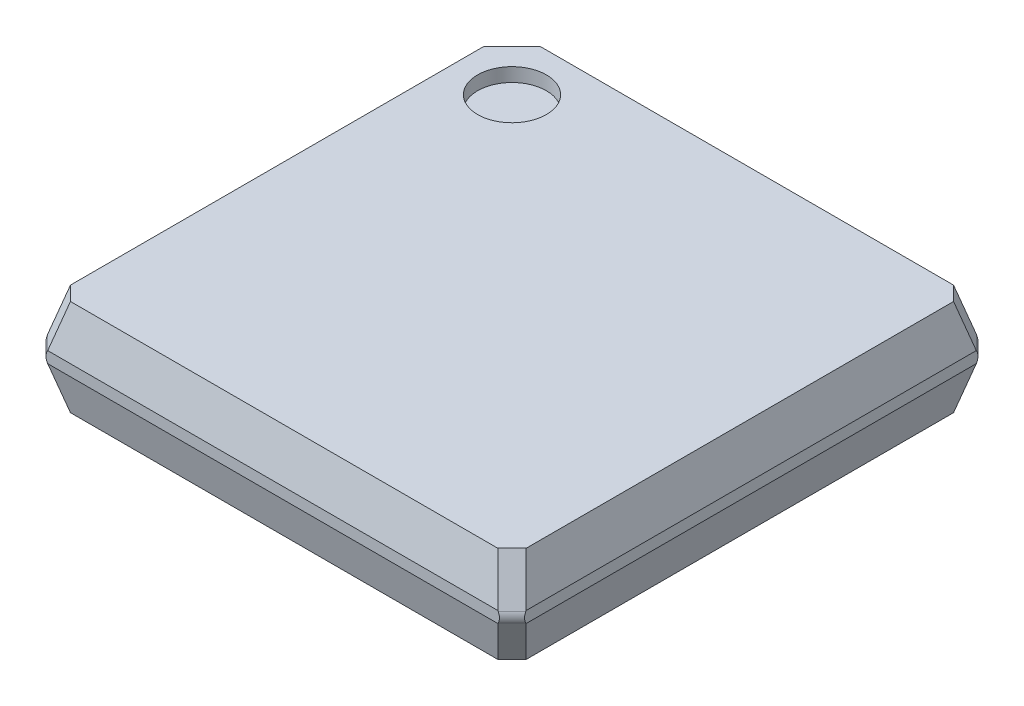
ISO-10303-21;
HEADER;
FILE_DESCRIPTION(('STEP AP214'),'2;1');
FILE_NAME('part.step','',(''),(''),'','','');
FILE_SCHEMA(('AUTOMOTIVE_DESIGN { 1 0 10303 214 1 1 1 1 }'));
ENDSEC;
DATA;
#1=APPLICATION_CONTEXT('core data for automotive mechanical design processes');
#2=APPLICATION_PROTOCOL_DEFINITION('international standard','automotive_design',2000,#1);
#3=PRODUCT_CONTEXT('',#1,'mechanical');
#4=PRODUCT('Part','Part','',(#3));
#5=PRODUCT_RELATED_PRODUCT_CATEGORY('part','',(#4));
#6=PRODUCT_DEFINITION_FORMATION('','',#4);
#7=PRODUCT_DEFINITION_CONTEXT('part definition',#1,'design');
#8=PRODUCT_DEFINITION('design','',#6,#7);
#9=PRODUCT_DEFINITION_SHAPE('','',#8);
#10=(LENGTH_UNIT() NAMED_UNIT(*) SI_UNIT(.MILLI.,.METRE.));
#11=(NAMED_UNIT(*) PLANE_ANGLE_UNIT() SI_UNIT($,.RADIAN.));
#12=(NAMED_UNIT(*) SI_UNIT($,.STERADIAN.) SOLID_ANGLE_UNIT());
#13=UNCERTAINTY_MEASURE_WITH_UNIT(LENGTH_MEASURE(1.E-05),#10,'distance_accuracy_value','');
#14=(GEOMETRIC_REPRESENTATION_CONTEXT(3) GLOBAL_UNCERTAINTY_ASSIGNED_CONTEXT((#13)) GLOBAL_UNIT_ASSIGNED_CONTEXT((#10,
#11,#12)) REPRESENTATION_CONTEXT('',''));
#15=CARTESIAN_POINT('',(0.,0.,0.));
#16=DIRECTION('',(0.,0.,1.));
#17=DIRECTION('',(1.,0.,0.));
#18=AXIS2_PLACEMENT_3D('',#15,#16,#17);
#19=CARTESIAN_POINT('',(-2.5,0.5,-2.5));
#20=DIRECTION('',(0.,1.,0.));
#21=DIRECTION('',(0.,0.,1.));
#22=AXIS2_PLACEMENT_3D('',#19,#20,#21);
#23=PLANE('',#22);
#24=CARTESIAN_POINT('',(-2.5,0.5,-2.5));
#25=DIRECTION('',(0.,-1.,0.));
#26=DIRECTION('',(0.,0.,-1.));
#27=AXIS2_PLACEMENT_3D('',#24,#25,#26);
#28=CIRCLE('',#27,0.5);
#29=CARTESIAN_POINT('',(-2.5,0.5,-3.));
#30=VERTEX_POINT('',#29);
#31=EDGE_CURVE('E19',#30,#30,#28,.F.);
#32=ORIENTED_EDGE('',*,*,#31,.T.);
#33=EDGE_LOOP('',(#32));
#34=FACE_BOUND('',#33,.T.);
#35=ADVANCED_FACE('F16',(#34),#23,.T.);
#36=CARTESIAN_POINT('',(-2.5,0.7,-2.5));
#37=DIRECTION('',(0.,-1.,0.));
#38=DIRECTION('',(0.,0.,-1.));
#39=AXIS2_PLACEMENT_3D('',#36,#37,#38);
#40=CYLINDRICAL_SURFACE('',#39,0.5);
#41=CARTESIAN_POINT('',(-2.5,0.7,-2.5));
#42=DIRECTION('',(0.,-1.,0.));
#43=DIRECTION('',(0.,0.,-1.));
#44=AXIS2_PLACEMENT_3D('',#41,#42,#43);
#45=CIRCLE('',#44,0.5);
#46=CARTESIAN_POINT('',(-2.5,0.7,-3.));
#47=VERTEX_POINT('',#46);
#48=EDGE_CURVE('E321',#47,#47,#45,.T.);
#49=ORIENTED_EDGE('',*,*,#48,.F.);
#50=EDGE_LOOP('',(#49));
#51=FACE_BOUND('',#50,.T.);
#52=ORIENTED_EDGE('',*,*,#31,.F.);
#53=EDGE_LOOP('',(#52));
#54=FACE_BOUND('',#53,.T.);
#55=ADVANCED_FACE('F376',(#51,#54),#40,.F.);
#56=CARTESIAN_POINT('',(0.,0.7,0.));
#57=DIRECTION('',(0.,1.,0.));
#58=DIRECTION('',(0.,0.,1.));
#59=AXIS2_PLACEMENT_3D('',#56,#57,#58);
#60=PLANE('',#59);
#61=ORIENTED_EDGE('',*,*,#48,.T.);
#62=EDGE_LOOP('',(#61));
#63=FACE_BOUND('',#62,.T.);
#64=DIRECTION('',(0.707106781186547,0.,0.707106781186548));
#65=VECTOR('',#64,1.);
#66=CARTESIAN_POINT('',(-3.20914048806277,0.700000000000001,3.20914048806277));
#67=LINE('',#66,#65);
#68=CARTESIAN_POINT('',(-3.10584541082731,0.7,3.31243556529822));
#69=VERTEX_POINT('',#68);
#70=CARTESIAN_POINT('',(-3.31243556529822,0.7,3.10584541082731));
#71=VERTEX_POINT('',#70);
#72=EDGE_CURVE('E296',#69,#71,#67,.F.);
#73=ORIENTED_EDGE('',*,*,#72,.F.);
#74=DIRECTION('',(1.,0.,0.));
#75=VECTOR('',#74,1.);
#76=CARTESIAN_POINT('',(-1.75,0.699999999999999,3.31243556529822));
#77=LINE('',#76,#75);
#78=CARTESIAN_POINT('',(3.10584541082731,0.7,3.31243556529822));
#79=VERTEX_POINT('',#78);
#80=EDGE_CURVE('E302',#79,#69,#77,.F.);
#81=ORIENTED_EDGE('',*,*,#80,.F.);
#82=DIRECTION('',(0.707106781186547,0.,-0.707106781186547));
#83=VECTOR('',#82,1.);
#84=CARTESIAN_POINT('',(3.10584541082731,0.7,3.31243556529822));
#85=LINE('',#84,#83);
#86=CARTESIAN_POINT('',(3.31243556529822,0.7,3.10584541082731));
#87=VERTEX_POINT('',#86);
#88=EDGE_CURVE('E328',#79,#87,#85,.T.);
#89=ORIENTED_EDGE('',*,*,#88,.T.);
#90=DIRECTION('',(0.,0.,1.));
#91=VECTOR('',#90,1.);
#92=CARTESIAN_POINT('',(3.31243556529822,0.699999999999999,1.75));
#93=LINE('',#92,#91);
#94=CARTESIAN_POINT('',(3.31243556529822,0.7,-3.10584541082731));
#95=VERTEX_POINT('',#94);
#96=EDGE_CURVE('E231',#95,#87,#93,.T.);
#97=ORIENTED_EDGE('',*,*,#96,.F.);
#98=DIRECTION('',(-0.707106781186547,0.,-0.707106781186548));
#99=VECTOR('',#98,1.);
#100=CARTESIAN_POINT('',(3.20914048806277,0.700000000000001,-3.20914048806277));
#101=LINE('',#100,#99);
#102=CARTESIAN_POINT('',(3.10584541082731,0.7,-3.31243556529822));
#103=VERTEX_POINT('',#102);
#104=EDGE_CURVE('E244',#103,#95,#101,.F.);
#105=ORIENTED_EDGE('',*,*,#104,.F.);
#106=DIRECTION('',(1.,0.,0.));
#107=VECTOR('',#106,1.);
#108=CARTESIAN_POINT('',(1.75,0.699999999999999,-3.31243556529822));
#109=LINE('',#108,#107);
#110=CARTESIAN_POINT('',(-2.89925525635641,0.699999999999999,-3.31243556529822));
#111=VERTEX_POINT('',#110);
#112=EDGE_CURVE('E257',#111,#103,#109,.T.);
#113=ORIENTED_EDGE('',*,*,#112,.F.);
#114=DIRECTION('',(-0.707106781186548,0.,0.707106781186547));
#115=VECTOR('',#114,1.);
#116=CARTESIAN_POINT('',(-3.10584541082731,0.699999999999998,-3.10584541082731));
#117=LINE('',#116,#115);
#118=CARTESIAN_POINT('',(-3.31243556529822,0.699999999999998,-2.89925525635641));
#119=VERTEX_POINT('',#118);
#120=EDGE_CURVE('E270',#119,#111,#117,.F.);
#121=ORIENTED_EDGE('',*,*,#120,.F.);
#122=DIRECTION('',(0.,0.,1.));
#123=VECTOR('',#122,1.);
#124=CARTESIAN_POINT('',(-3.31243556529822,0.699999999999999,-1.75));
#125=LINE('',#124,#123);
#126=EDGE_CURVE('E283',#71,#119,#125,.F.);
#127=ORIENTED_EDGE('',*,*,#126,.F.);
#128=EDGE_LOOP('',(#73,#81,#89,#97,#105,#113,#121,#127));
#129=FACE_BOUND('',#128,.T.);
#130=ADVANCED_FACE('F373',(#63,#129),#60,.T.);
#131=CARTESIAN_POINT('',(-1.75,0.35,3.40621778264911));
#132=DIRECTION('',(0.,0.258819045102521,0.965925826289068));
#133=DIRECTION('',(0.,-0.965925826289068,0.258819045102521));
#134=AXIS2_PLACEMENT_3D('',#131,#132,#133);
#135=PLANE('',#134);
#136=ORIENTED_EDGE('',*,*,#80,.T.);
#137=DIRECTION('',(0.250562807085731,0.93511312653103,-0.250562807085731));
#138=VECTOR('',#137,1.);
#139=CARTESIAN_POINT('',(-2.99874950137879,1.0996873753447,3.20533965584969));
#140=LINE('',#139,#138);
#141=CARTESIAN_POINT('',(-3.27141022669538,0.0821036952345711,3.47800038116629));
#142=VERTEX_POINT('',#141);
#143=EDGE_CURVE('E299',#142,#69,#140,.T.);
#144=ORIENTED_EDGE('',*,*,#143,.F.);
#145=DIRECTION('',(1.,0.,0.));
#146=VECTOR('',#145,1.);
#147=CARTESIAN_POINT('',(-1.75,0.0821036952345705,3.47800038116629));
#148=LINE('',#147,#146);
#149=CARTESIAN_POINT('',(3.27141022669538,0.0821036952345706,3.47800038116629));
#150=VERTEX_POINT('',#149);
#151=EDGE_CURVE('E305',#150,#142,#148,.F.);
#152=ORIENTED_EDGE('',*,*,#151,.F.);
#153=DIRECTION('',(-0.250562807085731,0.93511312653103,-0.250562807085731));
#154=VECTOR('',#153,1.);
#155=CARTESIAN_POINT('',(2.99874950137879,1.0996873753447,3.20533965584969));
#156=LINE('',#155,#154);
#157=EDGE_CURVE('E218',#79,#150,#156,.F.);
#158=ORIENTED_EDGE('',*,*,#157,.F.);
#159=EDGE_LOOP('',(#136,#144,#152,#158));
#160=FACE_BOUND('',#159,.T.);
#161=ADVANCED_FACE('F478',(#160),#135,.T.);
#162=CARTESIAN_POINT('',(-3.10204457861424,1.0996873753447,3.10204457861424));
#163=DIRECTION('',(-0.661224832946645,0.354349320006915,0.661224832946645));
#164=DIRECTION('',(0.707106781186547,0.,0.707106781186548));
#165=AXIS2_PLACEMENT_3D('',#162,#163,#164);
#166=PLANE('',#165);
#167=ORIENTED_EDGE('',*,*,#72,.T.);
#168=DIRECTION('',(0.250562807085732,0.93511312653103,-0.25056280708573));
#169=VECTOR('',#168,1.);
#170=CARTESIAN_POINT('',(-3.47800038116629,0.0821036952345703,3.27141022669538));
#171=LINE('',#170,#169);
#172=CARTESIAN_POINT('',(-3.47800038116629,0.0821036952345705,3.27141022669538));
#173=VERTEX_POINT('',#172);
#174=EDGE_CURVE('E293',#173,#71,#171,.T.);
#175=ORIENTED_EDGE('',*,*,#174,.F.);
#176=DIRECTION('',(0.,0.881412416655053,-0.472347490483753));
#177=VECTOR('',#176,1.);
#178=CARTESIAN_POINT('',(-3.47800038116629,0.0708698640013828,3.27743041870907));
#179=LINE('',#178,#177);
#180=CARTESIAN_POINT('',(-3.47800038116629,0.0708698640014341,3.27743041870904));
#181=VERTEX_POINT('',#180);
#182=EDGE_CURVE('E290',#181,#173,#179,.T.);
#183=ORIENTED_EDGE('',*,*,#182,.F.);
#184=DIRECTION('',(-0.707106781186548,0.,-0.707106781186548));
#185=VECTOR('',#184,1.);
#186=CARTESIAN_POINT('',(-3.37771539993768,0.0708698640013825,3.37771539993768));
#187=LINE('',#186,#185);
#188=CARTESIAN_POINT('',(-3.27743041870904,0.0708698640014322,3.47800038116629));
#189=VERTEX_POINT('',#188);
#190=EDGE_CURVE('E369',#189,#181,#187,.T.);
#191=ORIENTED_EDGE('',*,*,#190,.F.);
#192=DIRECTION('',(-0.472347490483729,-0.881412416655066,0.));
#193=VECTOR('',#192,1.);
#194=CARTESIAN_POINT('',(-3.27141022669538,0.0821036952345705,3.47800038116629));
#195=LINE('',#194,#193);
#196=EDGE_CURVE('E308',#142,#189,#195,.T.);
#197=ORIENTED_EDGE('',*,*,#196,.F.);
#198=ORIENTED_EDGE('',*,*,#143,.T.);
#199=EDGE_LOOP('',(#167,#175,#183,#191,#197,#198));
#200=FACE_BOUND('',#199,.T.);
#201=ADVANCED_FACE('F474',(#200),#166,.T.);
#202=CARTESIAN_POINT('',(-3.40621778264911,0.35,-1.75));
#203=DIRECTION('',(-0.965925826289068,0.258819045102521,0.));
#204=DIRECTION('',(-0.258819045102521,-0.965925826289068,0.));
#205=AXIS2_PLACEMENT_3D('',#202,#203,#204);
#206=PLANE('',#205);
#207=ORIENTED_EDGE('',*,*,#126,.T.);
#208=DIRECTION('',(0.250562807085732,0.935113126531029,0.250562807085732));
#209=VECTOR('',#208,1.);
#210=CARTESIAN_POINT('',(-3.21830974114332,1.05128235805038,-2.8051294322015));
#211=LINE('',#210,#209);
#212=CARTESIAN_POINT('',(-3.47800038116629,0.08210369523457,-3.06482007222448));
#213=VERTEX_POINT('',#212);
#214=EDGE_CURVE('E280',#213,#119,#211,.T.);
#215=ORIENTED_EDGE('',*,*,#214,.F.);
#216=DIRECTION('',(0.,0.,1.));
#217=VECTOR('',#216,1.);
#218=CARTESIAN_POINT('',(-3.47800038116629,0.0821036952345706,-1.75));
#219=LINE('',#218,#217);
#220=EDGE_CURVE('E286',#173,#213,#219,.F.);
#221=ORIENTED_EDGE('',*,*,#220,.F.);
#222=ORIENTED_EDGE('',*,*,#174,.T.);
#223=EDGE_LOOP('',(#207,#215,#221,#222));
#224=FACE_BOUND('',#223,.T.);
#225=ADVANCED_FACE('F470',(#224),#206,.T.);
#226=CARTESIAN_POINT('',(-3.01171958667241,1.05128235805038,-3.01171958667241));
#227=DIRECTION('',(-0.661224832946644,0.354349320006915,-0.661224832946645));
#228=DIRECTION('',(-0.707106781186548,0.,0.707106781186547));
#229=AXIS2_PLACEMENT_3D('',#226,#227,#228);
#230=PLANE('',#229);
#231=ORIENTED_EDGE('',*,*,#120,.T.);
#232=DIRECTION('',(0.25056280708573,0.93511312653103,0.250562807085732));
#233=VECTOR('',#232,1.);
#234=CARTESIAN_POINT('',(-3.06482007222448,0.0821036952345703,-3.47800038116629));
#235=LINE('',#234,#233);
#236=CARTESIAN_POINT('',(-3.06482007222448,0.0821036952345705,-3.47800038116629));
#237=VERTEX_POINT('',#236);
#238=EDGE_CURVE('E267',#237,#111,#235,.T.);
#239=ORIENTED_EDGE('',*,*,#238,.F.);
#240=DIRECTION('',(0.472347490483131,0.881412416655386,0.));
#241=VECTOR('',#240,1.);
#242=CARTESIAN_POINT('',(-3.07084026423816,0.0708698640013832,-3.47800038116629));
#243=LINE('',#242,#241);
#244=CARTESIAN_POINT('',(-3.07084026423817,0.0708698640013824,-3.47800038116629));
#245=VERTEX_POINT('',#244);
#246=EDGE_CURVE('E264',#245,#237,#243,.T.);
#247=ORIENTED_EDGE('',*,*,#246,.F.);
#248=DIRECTION('',(0.707106781186548,0.,-0.707106781186547));
#249=VECTOR('',#248,1.);
#250=CARTESIAN_POINT('',(-3.27442032270223,0.070869864001385,-3.27442032270223));
#251=LINE('',#250,#249);
#252=CARTESIAN_POINT('',(-3.47800038116629,0.0708698640013821,-3.07084026423817));
#253=VERTEX_POINT('',#252);
#254=EDGE_CURVE('E362',#253,#245,#251,.T.);
#255=ORIENTED_EDGE('',*,*,#254,.F.);
#256=DIRECTION('',(0.,-0.881412416655388,-0.472347490483128));
#257=VECTOR('',#256,1.);
#258=CARTESIAN_POINT('',(-3.47800038116629,0.0821036952345706,-3.06482007222448));
#259=LINE('',#258,#257);
#260=EDGE_CURVE('E289',#213,#253,#259,.T.);
#261=ORIENTED_EDGE('',*,*,#260,.F.);
#262=ORIENTED_EDGE('',*,*,#214,.T.);
#263=EDGE_LOOP('',(#231,#239,#247,#255,#261,#262));
#264=FACE_BOUND('',#263,.T.);
#265=ADVANCED_FACE('F466',(#264),#230,.T.);
#266=CARTESIAN_POINT('',(1.75,0.35,-3.40621778264911));
#267=DIRECTION('',(0.,0.258819045102521,-0.965925826289068));
#268=DIRECTION('',(0.,0.965925826289068,0.258819045102521));
#269=AXIS2_PLACEMENT_3D('',#266,#267,#268);
#270=PLANE('',#269);
#271=ORIENTED_EDGE('',*,*,#112,.T.);
#272=DIRECTION('',(-0.250562807085731,0.93511312653103,0.250562807085731));
#273=VECTOR('',#272,1.);
#274=CARTESIAN_POINT('',(2.99874950137879,1.0996873753447,-3.20533965584969));
#275=LINE('',#274,#273);
#276=CARTESIAN_POINT('',(3.27141022669538,0.0821036952345712,-3.47800038116629));
#277=VERTEX_POINT('',#276);
#278=EDGE_CURVE('E254',#277,#103,#275,.T.);
#279=ORIENTED_EDGE('',*,*,#278,.F.);
#280=DIRECTION('',(-1.,0.,0.));
#281=VECTOR('',#280,1.);
#282=CARTESIAN_POINT('',(1.75,0.0821036952345706,-3.47800038116629));
#283=LINE('',#282,#281);
#284=EDGE_CURVE('E260',#237,#277,#283,.F.);
#285=ORIENTED_EDGE('',*,*,#284,.F.);
#286=ORIENTED_EDGE('',*,*,#238,.T.);
#287=EDGE_LOOP('',(#271,#279,#285,#286));
#288=FACE_BOUND('',#287,.T.);
#289=ADVANCED_FACE('F462',(#288),#270,.T.);
#290=CARTESIAN_POINT('',(3.10204457861424,1.0996873753447,-3.10204457861424));
#291=DIRECTION('',(0.661224832946645,0.354349320006915,-0.661224832946645));
#292=DIRECTION('',(-0.707106781186547,0.,-0.707106781186548));
#293=AXIS2_PLACEMENT_3D('',#290,#291,#292);
#294=PLANE('',#293);
#295=ORIENTED_EDGE('',*,*,#104,.T.);
#296=DIRECTION('',(-0.250562807085732,0.93511312653103,0.25056280708573));
#297=VECTOR('',#296,1.);
#298=CARTESIAN_POINT('',(3.47800038116629,0.0821036952345703,-3.27141022669538));
#299=LINE('',#298,#297);
#300=CARTESIAN_POINT('',(3.47800038116629,0.0821036952345705,-3.27141022669538));
#301=VERTEX_POINT('',#300);
#302=EDGE_CURVE('E241',#301,#95,#299,.T.);
#303=ORIENTED_EDGE('',*,*,#302,.F.);
#304=DIRECTION('',(0.,0.881412416655055,0.472347490483749));
#305=VECTOR('',#304,1.);
#306=CARTESIAN_POINT('',(3.47800038116629,0.0708698640013827,-3.27743041870907));
#307=LINE('',#306,#305);
#308=CARTESIAN_POINT('',(3.47800038116629,0.0708698640014338,-3.27743041870904));
#309=VERTEX_POINT('',#308);
#310=EDGE_CURVE('E238',#309,#301,#307,.T.);
#311=ORIENTED_EDGE('',*,*,#310,.F.);
#312=DIRECTION('',(-0.707106781186548,0.,-0.707106781186548));
#313=VECTOR('',#312,1.);
#314=CARTESIAN_POINT('',(3.37771539993768,0.0708698640013824,-3.37771539993768));
#315=LINE('',#314,#313);
#316=CARTESIAN_POINT('',(3.27743041870904,0.0708698640014315,-3.47800038116629));
#317=VERTEX_POINT('',#316);
#318=EDGE_CURVE('E354',#317,#309,#315,.F.);
#319=ORIENTED_EDGE('',*,*,#318,.F.);
#320=DIRECTION('',(0.472347490483723,-0.881412416655069,0.));
#321=VECTOR('',#320,1.);
#322=CARTESIAN_POINT('',(3.27141022669538,0.0821036952345706,-3.47800038116629));
#323=LINE('',#322,#321);
#324=EDGE_CURVE('E263',#277,#317,#323,.T.);
#325=ORIENTED_EDGE('',*,*,#324,.F.);
#326=ORIENTED_EDGE('',*,*,#278,.T.);
#327=EDGE_LOOP('',(#295,#303,#311,#319,#325,#326));
#328=FACE_BOUND('',#327,.T.);
#329=ADVANCED_FACE('F458',(#328),#294,.T.);
#330=CARTESIAN_POINT('',(3.40621778264911,0.35,1.75));
#331=DIRECTION('',(0.965925826289068,0.258819045102521,0.));
#332=DIRECTION('',(-0.258819045102521,0.965925826289068,0.));
#333=AXIS2_PLACEMENT_3D('',#330,#331,#332);
#334=PLANE('',#333);
#335=ORIENTED_EDGE('',*,*,#96,.T.);
#336=DIRECTION('',(-0.250562807085731,0.93511312653103,-0.250562807085731));
#337=VECTOR('',#336,1.);
#338=CARTESIAN_POINT('',(3.20533965584969,1.0996873753447,2.99874950137879));
#339=LINE('',#338,#337);
#340=CARTESIAN_POINT('',(3.47800038116629,0.0821036952345712,3.27141022669538));
#341=VERTEX_POINT('',#340);
#342=EDGE_CURVE('E228',#341,#87,#339,.T.);
#343=ORIENTED_EDGE('',*,*,#342,.F.);
#344=DIRECTION('',(0.,0.,-1.));
#345=VECTOR('',#344,1.);
#346=CARTESIAN_POINT('',(3.47800038116629,0.0821036952345706,1.75));
#347=LINE('',#346,#345);
#348=EDGE_CURVE('E234',#301,#341,#347,.F.);
#349=ORIENTED_EDGE('',*,*,#348,.F.);
#350=ORIENTED_EDGE('',*,*,#302,.T.);
#351=EDGE_LOOP('',(#335,#343,#349,#350));
#352=FACE_BOUND('',#351,.T.);
#353=ADVANCED_FACE('F454',(#352),#334,.T.);
#354=CARTESIAN_POINT('',(3.10204457861424,1.0996873753447,3.10204457861424));
#355=DIRECTION('',(0.661224832946645,0.354349320006915,0.661224832946645));
#356=DIRECTION('',(0.707106781186548,0.,-0.707106781186547));
#357=AXIS2_PLACEMENT_3D('',#354,#355,#356);
#358=PLANE('',#357);
#359=DIRECTION('',(-0.472347490483753,0.881412416655053,0.));
#360=VECTOR('',#359,1.);
#361=CARTESIAN_POINT('',(3.27743041870907,0.0708698640013827,3.47800038116629));
#362=LINE('',#361,#360);
#363=CARTESIAN_POINT('',(3.27743041870904,0.0708698640014341,3.47800038116629));
#364=VERTEX_POINT('',#363);
#365=EDGE_CURVE('E187',#364,#150,#362,.T.);
#366=ORIENTED_EDGE('',*,*,#365,.F.);
#367=DIRECTION('',(0.707106781186548,0.,-0.707106781186548));
#368=VECTOR('',#367,1.);
#369=CARTESIAN_POINT('',(3.37771539993768,0.0708698640013824,3.37771539993768));
#370=LINE('',#369,#368);
#371=CARTESIAN_POINT('',(3.47800038116629,0.0708698640014315,3.27743041870904));
#372=VERTEX_POINT('',#371);
#373=EDGE_CURVE('E183',#372,#364,#370,.F.);
#374=ORIENTED_EDGE('',*,*,#373,.F.);
#375=DIRECTION('',(0.,-0.881412416655069,0.472347490483723));
#376=VECTOR('',#375,1.);
#377=CARTESIAN_POINT('',(3.47800038116629,0.0821036952345706,3.27141022669538));
#378=LINE('',#377,#376);
#379=EDGE_CURVE('E237',#341,#372,#378,.T.);
#380=ORIENTED_EDGE('',*,*,#379,.F.);
#381=ORIENTED_EDGE('',*,*,#342,.T.);
#382=ORIENTED_EDGE('',*,*,#88,.F.);
#383=ORIENTED_EDGE('',*,*,#157,.T.);
#384=EDGE_LOOP('',(#366,#374,#380,#381,#382,#383));
#385=FACE_BOUND('',#384,.T.);
#386=ADVANCED_FACE('F451',(#385),#358,.T.);
#387=CARTESIAN_POINT('',(3.24547043334835,0.,3.24547043334835));
#388=DIRECTION('',(0.707106781186548,0.,-0.707106781186548));
#389=DIRECTION('',(-0.707106781186548,0.,-0.707106781186548));
#390=AXIS2_PLACEMENT_3D('',#387,#388,#389);
#391=CYLINDRICAL_SURFACE('',#390,0.2);
#392=CARTESIAN_POINT('',(3.01294048553041,0.,3.47800038116629));
#393=DIRECTION('',(0.,0.,1.));
#394=DIRECTION('',(1.,0.,0.));
#395=AXIS2_PLACEMENT_3D('',#392,#393,#394);
#396=ELLIPSE('',#395,0.282842712474619,0.2);
#397=CARTESIAN_POINT('',(3.27743041870906,-0.0708698640014056,3.47800038116629));
#398=VERTEX_POINT('',#397);
#399=EDGE_CURVE('E176',#398,#364,#396,.T.);
#400=ORIENTED_EDGE('',*,*,#399,.F.);
#401=DIRECTION('',(0.707106781186548,0.,-0.707106781186547));
#402=VECTOR('',#401,1.);
#403=CARTESIAN_POINT('',(3.37771539993768,-0.070869864001382,3.37771539993768));
#404=LINE('',#403,#402);
#405=CARTESIAN_POINT('',(3.47800038116629,-0.0708698640014027,3.27743041870906));
#406=VERTEX_POINT('',#405);
#407=EDGE_CURVE('E181',#406,#398,#404,.F.);
#408=ORIENTED_EDGE('',*,*,#407,.F.);
#409=CARTESIAN_POINT('',(3.47800038116629,0.,3.01294048553041));
#410=DIRECTION('',(1.,0.,0.));
#411=DIRECTION('',(0.,0.,-1.));
#412=AXIS2_PLACEMENT_3D('',#409,#410,#411);
#413=ELLIPSE('',#412,0.282842712474619,0.2);
#414=EDGE_CURVE('E349',#372,#406,#413,.T.);
#415=ORIENTED_EDGE('',*,*,#414,.F.);
#416=ORIENTED_EDGE('',*,*,#373,.T.);
#417=EDGE_LOOP('',(#400,#408,#415,#416));
#418=FACE_BOUND('',#417,.T.);
#419=ADVANCED_FACE('F178',(#418),#391,.T.);
#420=CARTESIAN_POINT('',(-1.75,0.,3.47800038116629));
#421=DIRECTION('',(0.,0.,1.));
#422=DIRECTION('',(1.,0.,0.));
#423=AXIS2_PLACEMENT_3D('',#420,#421,#422);
#424=PLANE('',#423);
#425=ORIENTED_EDGE('',*,*,#196,.T.);
#426=CARTESIAN_POINT('',(-3.01294048553041,0.,3.47800038116629));
#427=DIRECTION('',(0.,0.,1.));
#428=DIRECTION('',(-1.,0.,0.));
#429=AXIS2_PLACEMENT_3D('',#426,#427,#428);
#430=ELLIPSE('',#429,0.282842712474619,0.2);
#431=CARTESIAN_POINT('',(-3.27743041870904,-0.0708698640014314,3.47800038116629));
#432=VERTEX_POINT('',#431);
#433=EDGE_CURVE('E367',#432,#189,#430,.F.);
#434=ORIENTED_EDGE('',*,*,#433,.F.);
#435=DIRECTION('',(0.472347490483723,-0.881412416655069,0.));
#436=VECTOR('',#435,1.);
#437=CARTESIAN_POINT('',(-3.27743041870907,-0.0708698640013827,3.47800038116629));
#438=LINE('',#437,#436);
#439=CARTESIAN_POINT('',(-3.27141022669538,-0.0821036952345705,3.47800038116629));
#440=VERTEX_POINT('',#439);
#441=EDGE_CURVE('E188',#432,#440,#438,.T.);
#442=ORIENTED_EDGE('',*,*,#441,.T.);
#443=DIRECTION('',(1.,0.,0.));
#444=VECTOR('',#443,1.);
#445=CARTESIAN_POINT('',(-1.75,-0.0821036952345703,3.47800038116629));
#446=LINE('',#445,#444);
#447=CARTESIAN_POINT('',(3.27141022669538,-0.0821036952345716,3.47800038116629));
#448=VERTEX_POINT('',#447);
#449=EDGE_CURVE('E194',#448,#440,#446,.F.);
#450=ORIENTED_EDGE('',*,*,#449,.F.);
#451=DIRECTION('',(-0.472347490483418,-0.881412416655232,3.06241499784307E-13));
#452=VECTOR('',#451,1.);
#453=CARTESIAN_POINT('',(3.27743041870907,-0.070869864001382,3.47800038116629));
#454=LINE('',#453,#452);
#455=EDGE_CURVE('E191',#398,#448,#454,.T.);
#456=ORIENTED_EDGE('',*,*,#455,.F.);
#457=ORIENTED_EDGE('',*,*,#399,.T.);
#458=ORIENTED_EDGE('',*,*,#365,.T.);
#459=ORIENTED_EDGE('',*,*,#151,.T.);
#460=EDGE_LOOP('',(#425,#434,#442,#450,#456,#457,#458,#459));
#461=FACE_BOUND('',#460,.T.);
#462=ADVANCED_FACE('F192',(#461),#424,.T.);
#463=CARTESIAN_POINT('',(-3.24547043334835,0.,3.24547043334835));
#464=DIRECTION('',(-0.707106781186548,0.,-0.707106781186548));
#465=DIRECTION('',(-0.707106781186548,0.,0.707106781186548));
#466=AXIS2_PLACEMENT_3D('',#463,#464,#465);
#467=CYLINDRICAL_SURFACE('',#466,0.2);
#468=ORIENTED_EDGE('',*,*,#433,.T.);
#469=ORIENTED_EDGE('',*,*,#190,.T.);
#470=CARTESIAN_POINT('',(-3.47800038116629,0.,3.01294048553041));
#471=DIRECTION('',(-1.,0.,0.));
#472=DIRECTION('',(0.,0.,-1.));
#473=AXIS2_PLACEMENT_3D('',#470,#471,#472);
#474=ELLIPSE('',#473,0.282842712474619,0.2);
#475=CARTESIAN_POINT('',(-3.47800038116629,-0.0708698640014049,3.27743041870906));
#476=VERTEX_POINT('',#475);
#477=EDGE_CURVE('E363',#476,#181,#474,.T.);
#478=ORIENTED_EDGE('',*,*,#477,.F.);
#479=DIRECTION('',(0.707106781186547,0.,0.707106781186548));
#480=VECTOR('',#479,1.);
#481=CARTESIAN_POINT('',(-3.37771539993768,-0.070869864001382,3.37771539993768));
#482=LINE('',#481,#480);
#483=EDGE_CURVE('E317',#432,#476,#482,.F.);
#484=ORIENTED_EDGE('',*,*,#483,.F.);
#485=EDGE_LOOP('',(#468,#469,#478,#484));
#486=FACE_BOUND('',#485,.T.);
#487=ADVANCED_FACE('F442',(#486),#467,.T.);
#488=CARTESIAN_POINT('',(-3.47800038116629,0.,-1.75));
#489=DIRECTION('',(-1.,0.,0.));
#490=DIRECTION('',(0.,0.,1.));
#491=AXIS2_PLACEMENT_3D('',#488,#489,#490);
#492=PLANE('',#491);
#493=DIRECTION('',(-3.06241499784303E-13,-0.881412416655236,-0.472347490483411));
#494=VECTOR('',#493,1.);
#495=CARTESIAN_POINT('',(-3.47800038116629,-0.070869864001382,3.27743041870907));
#496=LINE('',#495,#494);
#497=CARTESIAN_POINT('',(-3.47800038116629,-0.082103695234572,3.27141022669538));
#498=VERTEX_POINT('',#497);
#499=EDGE_CURVE('E215',#476,#498,#496,.T.);
#500=ORIENTED_EDGE('',*,*,#499,.F.);
#501=ORIENTED_EDGE('',*,*,#477,.T.);
#502=ORIENTED_EDGE('',*,*,#182,.T.);
#503=ORIENTED_EDGE('',*,*,#220,.T.);
#504=ORIENTED_EDGE('',*,*,#260,.T.);
#505=CARTESIAN_POINT('',(-3.47800038116629,0.,-2.80635033105951));
#506=DIRECTION('',(-1.,0.,0.));
#507=DIRECTION('',(0.,0.,-1.));
#508=AXIS2_PLACEMENT_3D('',#505,#506,#507);
#509=ELLIPSE('',#508,0.282842712474619,0.2);
#510=CARTESIAN_POINT('',(-3.47800038116629,-0.0708698640013802,-3.07084026423816));
#511=VERTEX_POINT('',#510);
#512=EDGE_CURVE('E359',#511,#253,#509,.F.);
#513=ORIENTED_EDGE('',*,*,#512,.F.);
#514=DIRECTION('',(0.,-0.881412416655392,0.472347490483121));
#515=VECTOR('',#514,1.);
#516=CARTESIAN_POINT('',(-3.47800038116629,-0.0708698640013828,-3.07084026423816));
#517=LINE('',#516,#515);
#518=CARTESIAN_POINT('',(-3.47800038116629,-0.0821036952345704,-3.06482007222448));
#519=VERTEX_POINT('',#518);
#520=EDGE_CURVE('E366',#511,#519,#517,.T.);
#521=ORIENTED_EDGE('',*,*,#520,.T.);
#522=DIRECTION('',(0.,0.,1.));
#523=VECTOR('',#522,1.);
#524=CARTESIAN_POINT('',(-3.47800038116629,-0.0821036952345702,-1.75));
#525=LINE('',#524,#523);
#526=EDGE_CURVE('E754',#498,#519,#525,.F.);
#527=ORIENTED_EDGE('',*,*,#526,.F.);
#528=EDGE_LOOP('',(#500,#501,#502,#503,#504,#513,#521,#527));
#529=FACE_BOUND('',#528,.T.);
#530=ADVANCED_FACE('F438',(#529),#492,.T.);
#531=CARTESIAN_POINT('',(-3.1421753561129,0.,-3.1421753561129));
#532=DIRECTION('',(0.707106781186548,0.,-0.707106781186547));
#533=DIRECTION('',(-0.707106781186547,0.,-0.707106781186548));
#534=AXIS2_PLACEMENT_3D('',#531,#532,#533);
#535=CYLINDRICAL_SURFACE('',#534,0.2);
#536=ORIENTED_EDGE('',*,*,#512,.T.);
#537=ORIENTED_EDGE('',*,*,#254,.T.);
#538=CARTESIAN_POINT('',(-2.80635033105951,0.,-3.47800038116629));
#539=DIRECTION('',(0.,0.,-1.));
#540=DIRECTION('',(1.,0.,0.));
#541=AXIS2_PLACEMENT_3D('',#538,#539,#540);
#542=ELLIPSE('',#541,0.282842712474619,0.2);
#543=CARTESIAN_POINT('',(-3.07084026423816,-0.0708698640013816,-3.47800038116629));
#544=VERTEX_POINT('',#543);
#545=EDGE_CURVE('E355',#544,#245,#542,.T.);
#546=ORIENTED_EDGE('',*,*,#545,.F.);
#547=DIRECTION('',(-0.707106781186549,0.,0.707106781186546));
#548=VECTOR('',#547,1.);
#549=CARTESIAN_POINT('',(-3.27442032270222,-0.0708698640013816,-3.27442032270222));
#550=LINE('',#549,#548);
#551=EDGE_CURVE('E276',#511,#544,#550,.F.);
#552=ORIENTED_EDGE('',*,*,#551,.F.);
#553=EDGE_LOOP('',(#536,#537,#546,#552));
#554=FACE_BOUND('',#553,.T.);
#555=ADVANCED_FACE('F434',(#554),#535,.T.);
#556=CARTESIAN_POINT('',(1.75,0.,-3.47800038116629));
#557=DIRECTION('',(0.,0.,-1.));
#558=DIRECTION('',(-1.,0.,0.));
#559=AXIS2_PLACEMENT_3D('',#556,#557,#558);
#560=PLANE('',#559);
#561=DIRECTION('',(0.472347490483138,-0.881412416655382,0.));
#562=VECTOR('',#561,1.);
#563=CARTESIAN_POINT('',(-3.07084026423816,-0.0708698640013812,-3.47800038116629));
#564=LINE('',#563,#562);
#565=CARTESIAN_POINT('',(-3.06482007222448,-0.082103695234569,-3.47800038116629));
#566=VERTEX_POINT('',#565);
#567=EDGE_CURVE('E277',#544,#566,#564,.T.);
#568=ORIENTED_EDGE('',*,*,#567,.F.);
#569=ORIENTED_EDGE('',*,*,#545,.T.);
#570=ORIENTED_EDGE('',*,*,#246,.T.);
#571=ORIENTED_EDGE('',*,*,#284,.T.);
#572=ORIENTED_EDGE('',*,*,#324,.T.);
#573=CARTESIAN_POINT('',(3.01294048553041,0.,-3.47800038116629));
#574=DIRECTION('',(0.,0.,-1.));
#575=DIRECTION('',(-1.,0.,0.));
#576=AXIS2_PLACEMENT_3D('',#573,#574,#575);
#577=ELLIPSE('',#576,0.282842712474619,0.2);
#578=CARTESIAN_POINT('',(3.27743041870904,-0.0708698640014319,-3.47800038116629));
#579=VERTEX_POINT('',#578);
#580=EDGE_CURVE('E351',#579,#317,#577,.F.);
#581=ORIENTED_EDGE('',*,*,#580,.F.);
#582=DIRECTION('',(-0.472347490483729,-0.881412416655066,0.));
#583=VECTOR('',#582,1.);
#584=CARTESIAN_POINT('',(3.27743041870907,-0.0708698640013828,-3.47800038116629));
#585=LINE('',#584,#583);
#586=CARTESIAN_POINT('',(3.27141022669538,-0.0821036952345704,-3.47800038116629));
#587=VERTEX_POINT('',#586);
#588=EDGE_CURVE('E358',#579,#587,#585,.T.);
#589=ORIENTED_EDGE('',*,*,#588,.T.);
#590=DIRECTION('',(1.,0.,0.));
#591=VECTOR('',#590,1.);
#592=CARTESIAN_POINT('',(1.75,-0.0821036952345702,-3.47800038116629));
#593=LINE('',#592,#591);
#594=EDGE_CURVE('E729',#566,#587,#593,.T.);
#595=ORIENTED_EDGE('',*,*,#594,.F.);
#596=EDGE_LOOP('',(#568,#569,#570,#571,#572,#581,#589,#595));
#597=FACE_BOUND('',#596,.T.);
#598=ADVANCED_FACE('F430',(#597),#560,.T.);
#599=CARTESIAN_POINT('',(3.24547043334835,0.,-3.24547043334835));
#600=DIRECTION('',(-0.707106781186548,0.,-0.707106781186548));
#601=DIRECTION('',(-0.707106781186548,0.,0.707106781186548));
#602=AXIS2_PLACEMENT_3D('',#599,#600,#601);
#603=CYLINDRICAL_SURFACE('',#602,0.2);
#604=ORIENTED_EDGE('',*,*,#580,.T.);
#605=ORIENTED_EDGE('',*,*,#318,.T.);
#606=CARTESIAN_POINT('',(3.47800038116629,0.,-3.01294048553041));
#607=DIRECTION('',(1.,0.,0.));
#608=DIRECTION('',(0.,0.,-1.));
#609=AXIS2_PLACEMENT_3D('',#606,#607,#608);
#610=ELLIPSE('',#609,0.282842712474619,0.2);
#611=CARTESIAN_POINT('',(3.47800038116629,-0.070869864001405,-3.27743041870906));
#612=VERTEX_POINT('',#611);
#613=EDGE_CURVE('E202',#612,#309,#610,.T.);
#614=ORIENTED_EDGE('',*,*,#613,.F.);
#615=DIRECTION('',(-0.707106781186547,0.,-0.707106781186548));
#616=VECTOR('',#615,1.);
#617=CARTESIAN_POINT('',(3.37771539993768,-0.070869864001382,-3.37771539993768));
#618=LINE('',#617,#616);
#619=EDGE_CURVE('E250',#579,#612,#618,.F.);
#620=ORIENTED_EDGE('',*,*,#619,.F.);
#621=EDGE_LOOP('',(#604,#605,#614,#620));
#622=FACE_BOUND('',#621,.T.);
#623=ADVANCED_FACE('F426',(#622),#603,.T.);
#624=CARTESIAN_POINT('',(3.47800038116629,0.,1.75));
#625=DIRECTION('',(1.,0.,0.));
#626=DIRECTION('',(0.,0.,-1.));
#627=AXIS2_PLACEMENT_3D('',#624,#625,#626);
#628=PLANE('',#627);
#629=DIRECTION('',(3.06241499784303E-13,-0.881412416655236,0.472347490483411));
#630=VECTOR('',#629,1.);
#631=CARTESIAN_POINT('',(3.47800038116629,-0.070869864001382,-3.27743041870907));
#632=LINE('',#631,#630);
#633=CARTESIAN_POINT('',(3.47800038116629,-0.0821036952345719,-3.27141022669538));
#634=VERTEX_POINT('',#633);
#635=EDGE_CURVE('E251',#612,#634,#632,.T.);
#636=ORIENTED_EDGE('',*,*,#635,.F.);
#637=ORIENTED_EDGE('',*,*,#613,.T.);
#638=ORIENTED_EDGE('',*,*,#310,.T.);
#639=ORIENTED_EDGE('',*,*,#348,.T.);
#640=ORIENTED_EDGE('',*,*,#379,.T.);
#641=ORIENTED_EDGE('',*,*,#414,.T.);
#642=DIRECTION('',(-3.40268333093675E-13,0.88141241665525,0.472347490483385));
#643=VECTOR('',#642,1.);
#644=CARTESIAN_POINT('',(3.47800038116629,-0.0821036952345722,3.27141022669538));
#645=LINE('',#644,#643);
#646=CARTESIAN_POINT('',(3.47800038116629,-0.082103695234571,3.27141022669538));
#647=VERTEX_POINT('',#646);
#648=EDGE_CURVE('E200',#647,#406,#645,.T.);
#649=ORIENTED_EDGE('',*,*,#648,.F.);
#650=DIRECTION('',(0.,0.,1.));
#651=VECTOR('',#650,1.);
#652=CARTESIAN_POINT('',(3.47800038116629,-0.0821036952345702,1.75));
#653=LINE('',#652,#651);
#654=EDGE_CURVE('E225',#634,#647,#653,.T.);
#655=ORIENTED_EDGE('',*,*,#654,.F.);
#656=EDGE_LOOP('',(#636,#637,#638,#639,#640,#641,#649,#655));
#657=FACE_BOUND('',#656,.T.);
#658=ADVANCED_FACE('F423',(#657),#628,.T.);
#659=CARTESIAN_POINT('',(3.10204457861424,-1.0996873753447,3.10204457861424));
#660=DIRECTION('',(0.661224832946645,-0.354349320006915,0.661224832946645));
#661=DIRECTION('',(0.707106781186548,0.,-0.707106781186547));
#662=AXIS2_PLACEMENT_3D('',#659,#660,#661);
#663=PLANE('',#662);
#664=DIRECTION('',(-0.707106781186547,0.,0.707106781186547));
#665=VECTOR('',#664,1.);
#666=CARTESIAN_POINT('',(3.31243556529822,-0.7,3.10584541082731));
#667=LINE('',#666,#665);
#668=CARTESIAN_POINT('',(3.31243556529822,-0.7,3.10584541082731));
#669=VERTEX_POINT('',#668);
#670=CARTESIAN_POINT('',(3.10584541082731,-0.7,3.31243556529822));
#671=VERTEX_POINT('',#670);
#672=EDGE_CURVE('E687',#669,#671,#667,.T.);
#673=ORIENTED_EDGE('',*,*,#672,.F.);
#674=DIRECTION('',(-0.250562807085732,-0.93511312653103,-0.25056280708573));
#675=VECTOR('',#674,1.);
#676=CARTESIAN_POINT('',(3.47800038116629,-0.0821036952345702,3.27141022669538));
#677=LINE('',#676,#675);
#678=EDGE_CURVE('E222',#647,#669,#677,.T.);
#679=ORIENTED_EDGE('',*,*,#678,.F.);
#680=ORIENTED_EDGE('',*,*,#648,.T.);
#681=ORIENTED_EDGE('',*,*,#407,.T.);
#682=ORIENTED_EDGE('',*,*,#455,.T.);
#683=DIRECTION('',(0.25056280708573,0.93511312653103,0.250562807085732));
#684=VECTOR('',#683,1.);
#685=CARTESIAN_POINT('',(3.10584541082731,-0.699999999999999,3.31243556529822));
#686=LINE('',#685,#684);
#687=EDGE_CURVE('E211',#671,#448,#686,.T.);
#688=ORIENTED_EDGE('',*,*,#687,.F.);
#689=EDGE_LOOP('',(#673,#679,#680,#681,#682,#688));
#690=FACE_BOUND('',#689,.T.);
#691=ADVANCED_FACE('F198',(#690),#663,.T.);
#692=CARTESIAN_POINT('',(-1.75,-0.35,3.40621778264911));
#693=DIRECTION('',(0.,-0.258819045102521,0.965925826289068));
#694=DIRECTION('',(0.,-0.965925826289068,-0.258819045102521));
#695=AXIS2_PLACEMENT_3D('',#692,#693,#694);
#696=PLANE('',#695);
#697=DIRECTION('',(1.,0.,0.));
#698=VECTOR('',#697,1.);
#699=CARTESIAN_POINT('',(0.,-0.7,3.31243556529822));
#700=LINE('',#699,#698);
#701=CARTESIAN_POINT('',(-3.10584541082731,-0.7,3.31243556529822));
#702=VERTEX_POINT('',#701);
#703=EDGE_CURVE('E684',#671,#702,#700,.F.);
#704=ORIENTED_EDGE('',*,*,#703,.F.);
#705=ORIENTED_EDGE('',*,*,#687,.T.);
#706=ORIENTED_EDGE('',*,*,#449,.T.);
#707=DIRECTION('',(-0.250562807085731,0.93511312653103,0.250562807085731));
#708=VECTOR('',#707,1.);
#709=CARTESIAN_POINT('',(-2.99874950137879,-1.0996873753447,3.20533965584969));
#710=LINE('',#709,#708);
#711=EDGE_CURVE('E314',#702,#440,#710,.T.);
#712=ORIENTED_EDGE('',*,*,#711,.F.);
#713=EDGE_LOOP('',(#704,#705,#706,#712));
#714=FACE_BOUND('',#713,.T.);
#715=ADVANCED_FACE('F416',(#714),#696,.T.);
#716=CARTESIAN_POINT('',(-3.10204457861424,-1.0996873753447,3.10204457861424));
#717=DIRECTION('',(-0.661224832946645,-0.354349320006915,0.661224832946645));
#718=DIRECTION('',(0.707106781186547,0.,0.707106781186548));
#719=AXIS2_PLACEMENT_3D('',#716,#717,#718);
#720=PLANE('',#719);
#721=ORIENTED_EDGE('',*,*,#441,.F.);
#722=ORIENTED_EDGE('',*,*,#483,.T.);
#723=ORIENTED_EDGE('',*,*,#499,.T.);
#724=DIRECTION('',(-0.250562807085732,0.93511312653103,0.25056280708573));
#725=VECTOR('',#724,1.);
#726=CARTESIAN_POINT('',(-3.31243556529822,-0.699999999999999,3.10584541082731));
#727=LINE('',#726,#725);
#728=CARTESIAN_POINT('',(-3.31243556529822,-0.7,3.10584541082731));
#729=VERTEX_POINT('',#728);
#730=EDGE_CURVE('E680',#729,#498,#727,.T.);
#731=ORIENTED_EDGE('',*,*,#730,.F.);
#732=DIRECTION('',(-0.707106781186547,0.,-0.707106781186547));
#733=VECTOR('',#732,1.);
#734=CARTESIAN_POINT('',(-3.10584541082731,-0.7,3.31243556529822));
#735=LINE('',#734,#733);
#736=EDGE_CURVE('E676',#702,#729,#735,.T.);
#737=ORIENTED_EDGE('',*,*,#736,.F.);
#738=ORIENTED_EDGE('',*,*,#711,.T.);
#739=EDGE_LOOP('',(#721,#722,#723,#731,#737,#738));
#740=FACE_BOUND('',#739,.T.);
#741=ADVANCED_FACE('F412',(#740),#720,.T.);
#742=CARTESIAN_POINT('',(-3.40621778264911,-0.35,-1.75));
#743=DIRECTION('',(-0.965925826289068,-0.258819045102521,0.));
#744=DIRECTION('',(0.258819045102521,-0.965925826289068,0.));
#745=AXIS2_PLACEMENT_3D('',#742,#743,#744);
#746=PLANE('',#745);
#747=DIRECTION('',(0.,0.,-1.));
#748=VECTOR('',#747,1.);
#749=CARTESIAN_POINT('',(-3.31243556529822,-0.7,0.));
#750=LINE('',#749,#748);
#751=CARTESIAN_POINT('',(-3.31243556529822,-0.699999999999999,-2.89925525635641));
#752=VERTEX_POINT('',#751);
#753=EDGE_CURVE('E683',#729,#752,#750,.T.);
#754=ORIENTED_EDGE('',*,*,#753,.F.);
#755=ORIENTED_EDGE('',*,*,#730,.T.);
#756=ORIENTED_EDGE('',*,*,#526,.T.);
#757=DIRECTION('',(-0.250562807085731,0.935113126531029,-0.250562807085732));
#758=VECTOR('',#757,1.);
#759=CARTESIAN_POINT('',(-3.21830974114332,-1.05128235805038,-2.80512943220151));
#760=LINE('',#759,#758);
#761=EDGE_CURVE('E273',#752,#519,#760,.T.);
#762=ORIENTED_EDGE('',*,*,#761,.F.);
#763=EDGE_LOOP('',(#754,#755,#756,#762));
#764=FACE_BOUND('',#763,.T.);
#765=ADVANCED_FACE('F408',(#764),#746,.T.);
#766=CARTESIAN_POINT('',(-3.01171958667241,-1.05128235805038,-3.01171958667241));
#767=DIRECTION('',(-0.661224832946644,-0.354349320006915,-0.661224832946646));
#768=DIRECTION('',(-0.707106781186549,0.,0.707106781186546));
#769=AXIS2_PLACEMENT_3D('',#766,#767,#768);
#770=PLANE('',#769);
#771=ORIENTED_EDGE('',*,*,#520,.F.);
#772=ORIENTED_EDGE('',*,*,#551,.T.);
#773=ORIENTED_EDGE('',*,*,#567,.T.);
#774=DIRECTION('',(-0.25056280708573,0.93511312653103,-0.250562807085732));
#775=VECTOR('',#774,1.);
#776=CARTESIAN_POINT('',(-2.89925525635641,-0.699999999999999,-3.31243556529822));
#777=LINE('',#776,#775);
#778=CARTESIAN_POINT('',(-2.89925525635641,-0.699999999999999,-3.31243556529822));
#779=VERTEX_POINT('',#778);
#780=EDGE_CURVE('E705',#779,#566,#777,.T.);
#781=ORIENTED_EDGE('',*,*,#780,.F.);
#782=DIRECTION('',(0.707106781186547,0.,-0.707106781186547));
#783=VECTOR('',#782,1.);
#784=CARTESIAN_POINT('',(-3.31243556529822,-0.7,-2.89925525635641));
#785=LINE('',#784,#783);
#786=EDGE_CURVE('E766',#752,#779,#785,.T.);
#787=ORIENTED_EDGE('',*,*,#786,.F.);
#788=ORIENTED_EDGE('',*,*,#761,.T.);
#789=EDGE_LOOP('',(#771,#772,#773,#781,#787,#788));
#790=FACE_BOUND('',#789,.T.);
#791=ADVANCED_FACE('F404',(#790),#770,.T.);
#792=CARTESIAN_POINT('',(1.75,-0.35,-3.40621778264911));
#793=DIRECTION('',(0.,-0.258819045102521,-0.965925826289068));
#794=DIRECTION('',(0.,0.965925826289068,-0.258819045102521));
#795=AXIS2_PLACEMENT_3D('',#792,#793,#794);
#796=PLANE('',#795);
#797=DIRECTION('',(1.,0.,0.));
#798=VECTOR('',#797,1.);
#799=CARTESIAN_POINT('',(0.,-0.7,-3.31243556529822));
#800=LINE('',#799,#798);
#801=CARTESIAN_POINT('',(3.10584541082731,-0.7,-3.31243556529822));
#802=VERTEX_POINT('',#801);
#803=EDGE_CURVE('E767',#779,#802,#800,.T.);
#804=ORIENTED_EDGE('',*,*,#803,.F.);
#805=ORIENTED_EDGE('',*,*,#780,.T.);
#806=ORIENTED_EDGE('',*,*,#594,.T.);
#807=DIRECTION('',(0.250562807085731,0.93511312653103,-0.250562807085731));
#808=VECTOR('',#807,1.);
#809=CARTESIAN_POINT('',(2.99874950137879,-1.0996873753447,-3.20533965584969));
#810=LINE('',#809,#808);
#811=EDGE_CURVE('E247',#802,#587,#810,.T.);
#812=ORIENTED_EDGE('',*,*,#811,.F.);
#813=EDGE_LOOP('',(#804,#805,#806,#812));
#814=FACE_BOUND('',#813,.T.);
#815=ADVANCED_FACE('F401',(#814),#796,.T.);
#816=CARTESIAN_POINT('',(3.10204457861424,-1.0996873753447,-3.10204457861424));
#817=DIRECTION('',(0.661224832946645,-0.354349320006915,-0.661224832946645));
#818=DIRECTION('',(-0.707106781186547,0.,-0.707106781186548));
#819=AXIS2_PLACEMENT_3D('',#816,#817,#818);
#820=PLANE('',#819);
#821=ORIENTED_EDGE('',*,*,#588,.F.);
#822=ORIENTED_EDGE('',*,*,#619,.T.);
#823=ORIENTED_EDGE('',*,*,#635,.T.);
#824=DIRECTION('',(0.250562807085732,0.93511312653103,-0.25056280708573));
#825=VECTOR('',#824,1.);
#826=CARTESIAN_POINT('',(3.31243556529822,-0.699999999999999,-3.10584541082731));
#827=LINE('',#826,#825);
#828=CARTESIAN_POINT('',(3.31243556529822,-0.7,-3.10584541082731));
#829=VERTEX_POINT('',#828);
#830=EDGE_CURVE('E34',#829,#634,#827,.T.);
#831=ORIENTED_EDGE('',*,*,#830,.F.);
#832=DIRECTION('',(0.707106781186547,0.,0.707106781186547));
#833=VECTOR('',#832,1.);
#834=CARTESIAN_POINT('',(3.10584541082731,-0.7,-3.31243556529822));
#835=LINE('',#834,#833);
#836=EDGE_CURVE('E25',#802,#829,#835,.T.);
#837=ORIENTED_EDGE('',*,*,#836,.F.);
#838=ORIENTED_EDGE('',*,*,#811,.T.);
#839=EDGE_LOOP('',(#821,#822,#823,#831,#837,#838));
#840=FACE_BOUND('',#839,.T.);
#841=ADVANCED_FACE('F394',(#840),#820,.T.);
#842=CARTESIAN_POINT('',(3.40621778264911,-0.35,1.75));
#843=DIRECTION('',(0.965925826289068,-0.258819045102521,0.));
#844=DIRECTION('',(0.258819045102521,0.965925826289068,0.));
#845=AXIS2_PLACEMENT_3D('',#842,#843,#844);
#846=PLANE('',#845);
#847=DIRECTION('',(0.,0.,-1.));
#848=VECTOR('',#847,1.);
#849=CARTESIAN_POINT('',(3.31243556529822,-0.7,0.));
#850=LINE('',#849,#848);
#851=EDGE_CURVE('E11',#829,#669,#850,.F.);
#852=ORIENTED_EDGE('',*,*,#851,.F.);
#853=ORIENTED_EDGE('',*,*,#830,.T.);
#854=ORIENTED_EDGE('',*,*,#654,.T.);
#855=ORIENTED_EDGE('',*,*,#678,.T.);
#856=EDGE_LOOP('',(#852,#853,#854,#855));
#857=FACE_BOUND('',#856,.T.);
#858=ADVANCED_FACE('F388',(#857),#846,.T.);
#859=CARTESIAN_POINT('',(0.,-0.7,0.));
#860=DIRECTION('',(0.,-1.,0.));
#861=DIRECTION('',(0.,0.,-1.));
#862=AXIS2_PLACEMENT_3D('',#859,#860,#861);
#863=PLANE('',#862);
#864=ORIENTED_EDGE('',*,*,#836,.T.);
#865=ORIENTED_EDGE('',*,*,#851,.T.);
#866=ORIENTED_EDGE('',*,*,#672,.T.);
#867=ORIENTED_EDGE('',*,*,#703,.T.);
#868=ORIENTED_EDGE('',*,*,#736,.T.);
#869=ORIENTED_EDGE('',*,*,#753,.T.);
#870=ORIENTED_EDGE('',*,*,#786,.T.);
#871=ORIENTED_EDGE('',*,*,#803,.T.);
#872=EDGE_LOOP('',(#864,#865,#866,#867,#868,#869,#870,#871));
#873=FACE_BOUND('',#872,.T.);
#874=ADVANCED_FACE('F386',(#873),#863,.T.);
#875=CLOSED_SHELL('',(#35,#55,#130,#161,#201,#225,#265,#289,#329,#353,#386,#419,#462,#487,#530,
#555,#598,#623,#658,#691,#715,#741,#765,#791,#815,#841,#858,#874));
#876=MANIFOLD_SOLID_BREP('B1',#875);
#877=ADVANCED_BREP_SHAPE_REPRESENTATION('',(#18,#876),#14);
#878=SHAPE_DEFINITION_REPRESENTATION(#9,#877);
ENDSEC;
END-ISO-10303-21;
